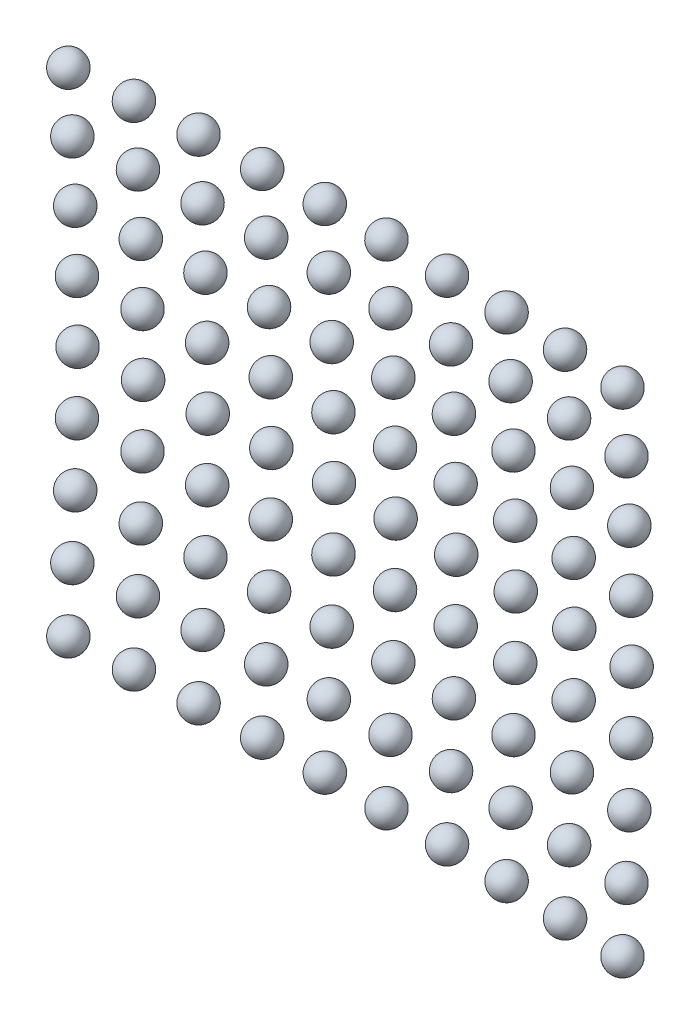
ISO-10303-21;
HEADER;
FILE_DESCRIPTION(('STEP AP214'),'2;1');
FILE_NAME('part.step','',(''),(''),'','','');
FILE_SCHEMA(('AUTOMOTIVE_DESIGN { 1 0 10303 214 1 1 1 1 }'));
ENDSEC;
DATA;
#1=APPLICATION_CONTEXT('core data for automotive mechanical design processes');
#2=APPLICATION_PROTOCOL_DEFINITION('international standard','automotive_design',2000,#1);
#3=PRODUCT_CONTEXT('',#1,'mechanical');
#4=PRODUCT('Part','Part','',(#3));
#5=PRODUCT_RELATED_PRODUCT_CATEGORY('part','',(#4));
#6=PRODUCT_DEFINITION_FORMATION('','',#4);
#7=PRODUCT_DEFINITION_CONTEXT('part definition',#1,'design');
#8=PRODUCT_DEFINITION('design','',#6,#7);
#9=PRODUCT_DEFINITION_SHAPE('','',#8);
#10=(LENGTH_UNIT() NAMED_UNIT(*) SI_UNIT(.MILLI.,.METRE.));
#11=(NAMED_UNIT(*) PLANE_ANGLE_UNIT() SI_UNIT($,.RADIAN.));
#12=(NAMED_UNIT(*) SI_UNIT($,.STERADIAN.) SOLID_ANGLE_UNIT());
#13=UNCERTAINTY_MEASURE_WITH_UNIT(LENGTH_MEASURE(1.E-05),#10,'distance_accuracy_value','');
#14=(GEOMETRIC_REPRESENTATION_CONTEXT(3) GLOBAL_UNCERTAINTY_ASSIGNED_CONTEXT((#13)) GLOBAL_UNIT_ASSIGNED_CONTEXT((#10,
#11,#12)) REPRESENTATION_CONTEXT('',''));
#15=CARTESIAN_POINT('',(0.,0.,0.));
#16=DIRECTION('',(0.,0.,1.));
#17=DIRECTION('',(1.,0.,0.));
#18=AXIS2_PLACEMENT_3D('',#15,#16,#17);
#19=CARTESIAN_POINT('',(8.00817179263602,-8.9214419487475,0.747647017793937));
#20=DIRECTION('',(0.,0.,-1.));
#21=DIRECTION('',(0.,-1.,0.));
#22=AXIS2_PLACEMENT_3D('',#19,#20,#21);
#23=SPHERICAL_SURFACE('',#22,0.5);
#24=CARTESIAN_POINT('',(8.00817179263602,-8.9214419487475,0.247647017793937));
#25=VERTEX_POINT('',#24);
#26=VERTEX_LOOP('',#25);
#27=FACE_BOUND('',#26,.T.);
#28=ADVANCED_FACE('F45',(#27),#23,.T.);
#29=CLOSED_SHELL('',(#28));
#30=MANIFOLD_SOLID_BREP('B2',#29);
#31=CARTESIAN_POINT('',(6.01259338943925,-8.9214419487475,0.615076387186788));
#32=DIRECTION('',(0.,0.,-1.));
#33=DIRECTION('',(0.,-1.,0.));
#34=AXIS2_PLACEMENT_3D('',#31,#32,#33);
#35=SPHERICAL_SURFACE('',#34,0.5);
#36=CARTESIAN_POINT('',(6.01259338943925,-8.9214419487475,0.115076387186788));
#37=VERTEX_POINT('',#36);
#38=VERTEX_LOOP('',#37);
#39=FACE_BOUND('',#38,.T.);
#40=ADVANCED_FACE('F65',(#39),#35,.T.);
#41=CLOSED_SHELL('',(#40));
#42=MANIFOLD_SOLID_BREP('B6',#41);
#43=CARTESIAN_POINT('',(4.01508925056326,-8.9214419487475,0.515651286844554));
#44=DIRECTION('',(0.,0.,-1.));
#45=DIRECTION('',(0.,-1.,0.));
#46=AXIS2_PLACEMENT_3D('',#43,#44,#45);
#47=SPHERICAL_SURFACE('',#46,0.5);
#48=CARTESIAN_POINT('',(4.01508925056326,-8.9214419487475,0.0156512868445537));
#49=VERTEX_POINT('',#48);
#50=VERTEX_LOOP('',#49);
#51=FACE_BOUND('',#50,.T.);
#52=ADVANCED_FACE('F85',(#51),#47,.T.);
#53=CLOSED_SHELL('',(#52));
#54=MANIFOLD_SOLID_BREP('B41',#53);
#55=CARTESIAN_POINT('',(2.01620986814937,-8.9214419487475,0.449399117329413));
#56=DIRECTION('',(0.,0.,-1.));
#57=DIRECTION('',(0.,-1.,0.));
#58=AXIS2_PLACEMENT_3D('',#55,#56,#57);
#59=SPHERICAL_SURFACE('',#58,0.5);
#60=CARTESIAN_POINT('',(2.01620986814937,-8.9214419487475,-0.0506008826705871));
#61=VERTEX_POINT('',#60);
#62=VERTEX_LOOP('',#61);
#63=FACE_BOUND('',#62,.T.);
#64=ADVANCED_FACE('F106',(#63),#59,.T.);
#65=CLOSED_SHELL('',(#64));
#66=MANIFOLD_SOLID_BREP('B61',#65);
#67=CARTESIAN_POINT('',(0.0165061133422777,-8.9214419487475,0.416338137075991));
#68=DIRECTION('',(0.,0.,-1.));
#69=DIRECTION('',(0.,-1.,0.));
#70=AXIS2_PLACEMENT_3D('',#67,#68,#69);
#71=SPHERICAL_SURFACE('',#70,0.5);
#72=CARTESIAN_POINT('',(0.0165061133422777,-8.9214419487475,-0.0836618629240086));
#73=VERTEX_POINT('',#72);
#74=VERTEX_LOOP('',#73);
#75=FACE_BOUND('',#74,.T.);
#76=ADVANCED_FACE('F127',(#75),#71,.T.);
#77=CLOSED_SHELL('',(#76));
#78=MANIFOLD_SOLID_BREP('B81',#77);
#79=CARTESIAN_POINT('',(-1.98347091552447,-8.9214419487475,0.416477457359412));
#80=DIRECTION('',(0.,0.,-1.));
#81=DIRECTION('',(0.,-1.,0.));
#82=AXIS2_PLACEMENT_3D('',#79,#80,#81);
#83=SPHERICAL_SURFACE('',#82,0.5);
#84=CARTESIAN_POINT('',(-1.98347091552447,-8.9214419487475,-0.0835225426405876));
#85=VERTEX_POINT('',#84);
#86=VERTEX_LOOP('',#85);
#87=FACE_BOUND('',#86,.T.);
#88=ADVANCED_FACE('F148',(#87),#83,.T.);
#89=CLOSED_SHELL('',(#88));
#90=MANIFOLD_SOLID_BREP('B102',#89);
#91=CARTESIAN_POINT('',(-3.98317004480583,-8.9214419487475,0.449817039784403));
#92=DIRECTION('',(0.,0.,-1.));
#93=DIRECTION('',(0.,-1.,0.));
#94=AXIS2_PLACEMENT_3D('',#91,#92,#93);
#95=SPHERICAL_SURFACE('',#94,0.5);
#96=CARTESIAN_POINT('',(-3.98317004480583,-8.9214419487475,-0.0501829602155971));
#97=VERTEX_POINT('',#96);
#98=VERTEX_LOOP('',#97);
#99=FACE_BOUND('',#98,.T.);
#100=ADVANCED_FACE('F169',(#99),#95,.T.);
#101=CLOSED_SHELL('',(#100));
#102=MANIFOLD_SOLID_BREP('B123',#101);
#103=CARTESIAN_POINT('',(-5.982040177443,-8.9214419487475,0.516347696295841));
#104=DIRECTION('',(0.,0.,-1.));
#105=DIRECTION('',(0.,-1.,0.));
#106=AXIS2_PLACEMENT_3D('',#103,#104,#105);
#107=SPHERICAL_SURFACE('',#106,0.5);
#108=CARTESIAN_POINT('',(-5.982040177443,-8.9214419487475,0.0163476962958405));
#109=VERTEX_POINT('',#108);
#110=VERTEX_LOOP('',#109);
#111=FACE_BOUND('',#110,.T.);
#112=ADVANCED_FACE('F190',(#111),#107,.T.);
#113=CLOSED_SHELL('',(#112));
#114=MANIFOLD_SOLID_BREP('B144',#113);
#115=CARTESIAN_POINT('',(-7.97953044484047,-8.9214419487475,0.616051091710923));
#116=DIRECTION('',(0.,0.,-1.));
#117=DIRECTION('',(0.,-1.,0.));
#118=AXIS2_PLACEMENT_3D('',#115,#116,#117);
#119=SPHERICAL_SURFACE('',#118,0.5);
#120=CARTESIAN_POINT('',(-7.97953044484047,-8.9214419487475,0.116051091710923));
#121=VERTEX_POINT('',#120);
#122=VERTEX_LOOP('',#121);
#123=FACE_BOUND('',#122,.T.);
#124=ADVANCED_FACE('F211',(#123),#119,.T.);
#125=CLOSED_SHELL('',(#124));
#126=MANIFOLD_SOLID_BREP('B165',#125);
#127=CARTESIAN_POINT('',(-9.97509035867965,-8.9214419487475,0.748899748772111));
#128=DIRECTION('',(0.,0.,-1.));
#129=DIRECTION('',(0.,-1.,0.));
#130=AXIS2_PLACEMENT_3D('',#127,#128,#129);
#131=SPHERICAL_SURFACE('',#130,0.5);
#132=CARTESIAN_POINT('',(-9.97509035867965,-8.9214419487475,0.248899748772111));
#133=VERTEX_POINT('',#132);
#134=VERTEX_LOOP('',#133);
#135=FACE_BOUND('',#134,.T.);
#136=ADVANCED_FACE('F232',(#135),#131,.T.);
#137=CLOSED_SHELL('',(#136));
#138=MANIFOLD_SOLID_BREP('B186',#137);
#139=CARTESIAN_POINT('',(8.00817179263602,-6.92569907133099,0.617666145492551));
#140=DIRECTION('',(0.,0.,-1.));
#141=DIRECTION('',(0.,-1.,0.));
#142=AXIS2_PLACEMENT_3D('',#139,#140,#141);
#143=SPHERICAL_SURFACE('',#142,0.5);
#144=CARTESIAN_POINT('',(8.00817179263602,-6.92569907133099,0.117666145492551));
#145=VERTEX_POINT('',#144);
#146=VERTEX_LOOP('',#145);
#147=FACE_BOUND('',#146,.T.);
#148=ADVANCED_FACE('F252',(#147),#143,.T.);
#149=CLOSED_SHELL('',(#148));
#150=MANIFOLD_SOLID_BREP('B207',#149);
#151=CARTESIAN_POINT('',(6.01259338943925,-6.92569907133099,0.485095514885403));
#152=DIRECTION('',(0.,0.,-1.));
#153=DIRECTION('',(0.,-1.,0.));
#154=AXIS2_PLACEMENT_3D('',#151,#152,#153);
#155=SPHERICAL_SURFACE('',#154,0.5);
#156=CARTESIAN_POINT('',(6.01259338943925,-6.92569907133099,-0.0149044851145972));
#157=VERTEX_POINT('',#156);
#158=VERTEX_LOOP('',#157);
#159=FACE_BOUND('',#158,.T.);
#160=ADVANCED_FACE('F272',(#159),#155,.T.);
#161=CLOSED_SHELL('',(#160));
#162=MANIFOLD_SOLID_BREP('B228',#161);
#163=CARTESIAN_POINT('',(4.01508925056326,-6.92569907133099,0.385670414543168));
#164=DIRECTION('',(0.,0.,-1.));
#165=DIRECTION('',(0.,-1.,0.));
#166=AXIS2_PLACEMENT_3D('',#163,#164,#165);
#167=SPHERICAL_SURFACE('',#166,0.5);
#168=CARTESIAN_POINT('',(4.01508925056326,-6.92569907133099,-0.114329585456832));
#169=VERTEX_POINT('',#168);
#170=VERTEX_LOOP('',#169);
#171=FACE_BOUND('',#170,.T.);
#172=ADVANCED_FACE('F292',(#171),#167,.T.);
#173=CLOSED_SHELL('',(#172));
#174=MANIFOLD_SOLID_BREP('B248',#173);
#175=CARTESIAN_POINT('',(2.01620986814937,-6.92569907133099,0.319418245028027));
#176=DIRECTION('',(0.,0.,-1.));
#177=DIRECTION('',(0.,-1.,0.));
#178=AXIS2_PLACEMENT_3D('',#175,#176,#177);
#179=SPHERICAL_SURFACE('',#178,0.5);
#180=CARTESIAN_POINT('',(2.01620986814937,-6.92569907133099,-0.180581754971973));
#181=VERTEX_POINT('',#180);
#182=VERTEX_LOOP('',#181);
#183=FACE_BOUND('',#182,.T.);
#184=ADVANCED_FACE('F313',(#183),#179,.T.);
#185=CLOSED_SHELL('',(#184));
#186=MANIFOLD_SOLID_BREP('B268',#185);
#187=CARTESIAN_POINT('',(0.0165061133422777,-6.92569907133099,0.286357264774606));
#188=DIRECTION('',(0.,0.,-1.));
#189=DIRECTION('',(0.,-1.,0.));
#190=AXIS2_PLACEMENT_3D('',#187,#188,#189);
#191=SPHERICAL_SURFACE('',#190,0.5);
#192=CARTESIAN_POINT('',(0.0165061133422777,-6.92569907133099,-0.213642735225394));
#193=VERTEX_POINT('',#192);
#194=VERTEX_LOOP('',#193);
#195=FACE_BOUND('',#194,.T.);
#196=ADVANCED_FACE('F334',(#195),#191,.T.);
#197=CLOSED_SHELL('',(#196));
#198=MANIFOLD_SOLID_BREP('B288',#197);
#199=CARTESIAN_POINT('',(-1.98347091552447,-6.92569907133099,0.286496585058027));
#200=DIRECTION('',(0.,0.,-1.));
#201=DIRECTION('',(0.,-1.,0.));
#202=AXIS2_PLACEMENT_3D('',#199,#200,#201);
#203=SPHERICAL_SURFACE('',#202,0.5);
#204=CARTESIAN_POINT('',(-1.98347091552447,-6.92569907133099,-0.213503414941973));
#205=VERTEX_POINT('',#204);
#206=VERTEX_LOOP('',#205);
#207=FACE_BOUND('',#206,.T.);
#208=ADVANCED_FACE('F355',(#207),#203,.T.);
#209=CLOSED_SHELL('',(#208));
#210=MANIFOLD_SOLID_BREP('B309',#209);
#211=CARTESIAN_POINT('',(-3.98317004480583,-6.92569907133099,0.319836167483017));
#212=DIRECTION('',(0.,0.,-1.));
#213=DIRECTION('',(0.,-1.,0.));
#214=AXIS2_PLACEMENT_3D('',#211,#212,#213);
#215=SPHERICAL_SURFACE('',#214,0.5);
#216=CARTESIAN_POINT('',(-3.98317004480583,-6.92569907133099,-0.180163832516983));
#217=VERTEX_POINT('',#216);
#218=VERTEX_LOOP('',#217);
#219=FACE_BOUND('',#218,.T.);
#220=ADVANCED_FACE('F376',(#219),#215,.T.);
#221=CLOSED_SHELL('',(#220));
#222=MANIFOLD_SOLID_BREP('B330',#221);
#223=CARTESIAN_POINT('',(-5.982040177443,-6.92569907133099,0.386366823994455));
#224=DIRECTION('',(0.,0.,-1.));
#225=DIRECTION('',(0.,-1.,0.));
#226=AXIS2_PLACEMENT_3D('',#223,#224,#225);
#227=SPHERICAL_SURFACE('',#226,0.5);
#228=CARTESIAN_POINT('',(-5.982040177443,-6.92569907133099,-0.113633176005545));
#229=VERTEX_POINT('',#228);
#230=VERTEX_LOOP('',#229);
#231=FACE_BOUND('',#230,.T.);
#232=ADVANCED_FACE('F397',(#231),#227,.T.);
#233=CLOSED_SHELL('',(#232));
#234=MANIFOLD_SOLID_BREP('B351',#233);
#235=CARTESIAN_POINT('',(-7.97953044484047,-6.92569907133099,0.486070219409537));
#236=DIRECTION('',(0.,0.,-1.));
#237=DIRECTION('',(0.,-1.,0.));
#238=AXIS2_PLACEMENT_3D('',#235,#236,#237);
#239=SPHERICAL_SURFACE('',#238,0.5);
#240=CARTESIAN_POINT('',(-7.97953044484047,-6.92569907133099,-0.0139297805904629));
#241=VERTEX_POINT('',#240);
#242=VERTEX_LOOP('',#241);
#243=FACE_BOUND('',#242,.T.);
#244=ADVANCED_FACE('F418',(#243),#239,.T.);
#245=CLOSED_SHELL('',(#244));
#246=MANIFOLD_SOLID_BREP('B372',#245);
#247=CARTESIAN_POINT('',(-9.97509035867965,-6.92569907133099,0.618918876470725));
#248=DIRECTION('',(0.,0.,-1.));
#249=DIRECTION('',(0.,-1.,0.));
#250=AXIS2_PLACEMENT_3D('',#247,#248,#249);
#251=SPHERICAL_SURFACE('',#250,0.5);
#252=CARTESIAN_POINT('',(-9.97509035867965,-6.92569907133099,0.118918876470725));
#253=VERTEX_POINT('',#252);
#254=VERTEX_LOOP('',#253);
#255=FACE_BOUND('',#254,.T.);
#256=ADVANCED_FACE('F439',(#255),#251,.T.);
#257=CLOSED_SHELL('',(#256));
#258=MANIFOLD_SOLID_BREP('B393',#257);
#259=CARTESIAN_POINT('',(8.00817179263602,-4.92788374246977,0.524829882696809));
#260=DIRECTION('',(0.,0.,-1.));
#261=DIRECTION('',(0.,-1.,0.));
#262=AXIS2_PLACEMENT_3D('',#259,#260,#261);
#263=SPHERICAL_SURFACE('',#262,0.5);
#264=CARTESIAN_POINT('',(8.00817179263602,-4.92788374246977,0.0248298826968087));
#265=VERTEX_POINT('',#264);
#266=VERTEX_LOOP('',#265);
#267=FACE_BOUND('',#266,.T.);
#268=ADVANCED_FACE('F459',(#267),#263,.T.);
#269=CLOSED_SHELL('',(#268));
#270=MANIFOLD_SOLID_BREP('B414',#269);
#271=CARTESIAN_POINT('',(6.01259338943925,-4.92788374246977,0.39225925208966));
#272=DIRECTION('',(0.,0.,-1.));
#273=DIRECTION('',(0.,-1.,0.));
#274=AXIS2_PLACEMENT_3D('',#271,#272,#273);
#275=SPHERICAL_SURFACE('',#274,0.5);
#276=CARTESIAN_POINT('',(6.01259338943925,-4.92788374246977,-0.10774074791034));
#277=VERTEX_POINT('',#276);
#278=VERTEX_LOOP('',#277);
#279=FACE_BOUND('',#278,.T.);
#280=ADVANCED_FACE('F479',(#279),#275,.T.);
#281=CLOSED_SHELL('',(#280));
#282=MANIFOLD_SOLID_BREP('B435',#281);
#283=CARTESIAN_POINT('',(4.01508925056326,-4.92788374246977,0.292834151747426));
#284=DIRECTION('',(0.,0.,-1.));
#285=DIRECTION('',(0.,-1.,0.));
#286=AXIS2_PLACEMENT_3D('',#283,#284,#285);
#287=SPHERICAL_SURFACE('',#286,0.5);
#288=CARTESIAN_POINT('',(4.01508925056326,-4.92788374246977,-0.207165848252574));
#289=VERTEX_POINT('',#288);
#290=VERTEX_LOOP('',#289);
#291=FACE_BOUND('',#290,.T.);
#292=ADVANCED_FACE('F499',(#291),#287,.T.);
#293=CLOSED_SHELL('',(#292));
#294=MANIFOLD_SOLID_BREP('B455',#293);
#295=CARTESIAN_POINT('',(2.01620986814937,-4.92788374246977,0.226581982232285));
#296=DIRECTION('',(0.,0.,-1.));
#297=DIRECTION('',(0.,-1.,0.));
#298=AXIS2_PLACEMENT_3D('',#295,#296,#297);
#299=SPHERICAL_SURFACE('',#298,0.5);
#300=CARTESIAN_POINT('',(2.01620986814937,-4.92788374246977,-0.273418017767715));
#301=VERTEX_POINT('',#300);
#302=VERTEX_LOOP('',#301);
#303=FACE_BOUND('',#302,.T.);
#304=ADVANCED_FACE('F520',(#303),#299,.T.);
#305=CLOSED_SHELL('',(#304));
#306=MANIFOLD_SOLID_BREP('B475',#305);
#307=CARTESIAN_POINT('',(0.0165061133422777,-4.92788374246977,0.193521001978863));
#308=DIRECTION('',(0.,0.,-1.));
#309=DIRECTION('',(0.,-1.,0.));
#310=AXIS2_PLACEMENT_3D('',#307,#308,#309);
#311=SPHERICAL_SURFACE('',#310,0.5);
#312=CARTESIAN_POINT('',(0.0165061133422777,-4.92788374246977,-0.306478998021137));
#313=VERTEX_POINT('',#312);
#314=VERTEX_LOOP('',#313);
#315=FACE_BOUND('',#314,.T.);
#316=ADVANCED_FACE('F541',(#315),#311,.T.);
#317=CLOSED_SHELL('',(#316));
#318=MANIFOLD_SOLID_BREP('B495',#317);
#319=CARTESIAN_POINT('',(-1.98347091552447,-4.92788374246977,0.193660322262284));
#320=DIRECTION('',(0.,0.,-1.));
#321=DIRECTION('',(0.,-1.,0.));
#322=AXIS2_PLACEMENT_3D('',#319,#320,#321);
#323=SPHERICAL_SURFACE('',#322,0.5);
#324=CARTESIAN_POINT('',(-1.98347091552447,-4.92788374246977,-0.306339677737716));
#325=VERTEX_POINT('',#324);
#326=VERTEX_LOOP('',#325);
#327=FACE_BOUND('',#326,.T.);
#328=ADVANCED_FACE('F562',(#327),#323,.T.);
#329=CLOSED_SHELL('',(#328));
#330=MANIFOLD_SOLID_BREP('B516',#329);
#331=CARTESIAN_POINT('',(-3.98317004480583,-4.92788374246977,0.226999904687275));
#332=DIRECTION('',(0.,0.,-1.));
#333=DIRECTION('',(0.,-1.,0.));
#334=AXIS2_PLACEMENT_3D('',#331,#332,#333);
#335=SPHERICAL_SURFACE('',#334,0.5);
#336=CARTESIAN_POINT('',(-3.98317004480583,-4.92788374246977,-0.273000095312725));
#337=VERTEX_POINT('',#336);
#338=VERTEX_LOOP('',#337);
#339=FACE_BOUND('',#338,.T.);
#340=ADVANCED_FACE('F583',(#339),#335,.T.);
#341=CLOSED_SHELL('',(#340));
#342=MANIFOLD_SOLID_BREP('B537',#341);
#343=CARTESIAN_POINT('',(-5.982040177443,-4.92788374246977,0.293530561198712));
#344=DIRECTION('',(0.,0.,-1.));
#345=DIRECTION('',(0.,-1.,0.));
#346=AXIS2_PLACEMENT_3D('',#343,#344,#345);
#347=SPHERICAL_SURFACE('',#346,0.5);
#348=CARTESIAN_POINT('',(-5.982040177443,-4.92788374246977,-0.206469438801288));
#349=VERTEX_POINT('',#348);
#350=VERTEX_LOOP('',#349);
#351=FACE_BOUND('',#350,.T.);
#352=ADVANCED_FACE('F604',(#351),#347,.T.);
#353=CLOSED_SHELL('',(#352));
#354=MANIFOLD_SOLID_BREP('B558',#353);
#355=CARTESIAN_POINT('',(-7.97953044484047,-4.92788374246977,0.393233956613795));
#356=DIRECTION('',(0.,0.,-1.));
#357=DIRECTION('',(0.,-1.,0.));
#358=AXIS2_PLACEMENT_3D('',#355,#356,#357);
#359=SPHERICAL_SURFACE('',#358,0.5);
#360=CARTESIAN_POINT('',(-7.97953044484047,-4.92788374246977,-0.106766043386205));
#361=VERTEX_POINT('',#360);
#362=VERTEX_LOOP('',#361);
#363=FACE_BOUND('',#362,.T.);
#364=ADVANCED_FACE('F625',(#363),#359,.T.);
#365=CLOSED_SHELL('',(#364));
#366=MANIFOLD_SOLID_BREP('B579',#365);
#367=CARTESIAN_POINT('',(-9.97509035867965,-4.92788374246977,0.526082613674983));
#368=DIRECTION('',(0.,0.,-1.));
#369=DIRECTION('',(0.,-1.,0.));
#370=AXIS2_PLACEMENT_3D('',#367,#368,#369);
#371=SPHERICAL_SURFACE('',#370,0.5);
#372=CARTESIAN_POINT('',(-9.97509035867965,-4.92788374246977,0.0260826136749828));
#373=VERTEX_POINT('',#372);
#374=VERTEX_LOOP('',#373);
#375=FACE_BOUND('',#374,.T.);
#376=ADVANCED_FACE('F646',(#375),#371,.T.);
#377=CLOSED_SHELL('',(#376));
#378=MANIFOLD_SOLID_BREP('B600',#377);
#379=CARTESIAN_POINT('',(8.00817179263602,-2.92868723472621,0.469170352076081));
#380=DIRECTION('',(0.,0.,-1.));
#381=DIRECTION('',(0.,-1.,0.));
#382=AXIS2_PLACEMENT_3D('',#379,#380,#381);
#383=SPHERICAL_SURFACE('',#382,0.5);
#384=CARTESIAN_POINT('',(8.00817179263602,-2.92868723472621,-0.0308296479239187));
#385=VERTEX_POINT('',#384);
#386=VERTEX_LOOP('',#385);
#387=FACE_BOUND('',#386,.T.);
#388=ADVANCED_FACE('F666',(#387),#383,.T.);
#389=CLOSED_SHELL('',(#388));
#390=MANIFOLD_SOLID_BREP('B621',#389);
#391=CARTESIAN_POINT('',(6.01259338943925,-2.92868723472621,0.336599721468933));
#392=DIRECTION('',(0.,0.,-1.));
#393=DIRECTION('',(0.,-1.,0.));
#394=AXIS2_PLACEMENT_3D('',#391,#392,#393);
#395=SPHERICAL_SURFACE('',#394,0.5);
#396=CARTESIAN_POINT('',(6.01259338943925,-2.92868723472621,-0.163400278531067));
#397=VERTEX_POINT('',#396);
#398=VERTEX_LOOP('',#397);
#399=FACE_BOUND('',#398,.T.);
#400=ADVANCED_FACE('F686',(#399),#395,.T.);
#401=CLOSED_SHELL('',(#400));
#402=MANIFOLD_SOLID_BREP('B642',#401);
#403=CARTESIAN_POINT('',(4.01508925056326,-2.92868723472621,0.237174621126698));
#404=DIRECTION('',(0.,0.,-1.));
#405=DIRECTION('',(0.,-1.,0.));
#406=AXIS2_PLACEMENT_3D('',#403,#404,#405);
#407=SPHERICAL_SURFACE('',#406,0.5);
#408=CARTESIAN_POINT('',(4.01508925056326,-2.92868723472621,-0.262825378873302));
#409=VERTEX_POINT('',#408);
#410=VERTEX_LOOP('',#409);
#411=FACE_BOUND('',#410,.T.);
#412=ADVANCED_FACE('F706',(#411),#407,.T.);
#413=CLOSED_SHELL('',(#412));
#414=MANIFOLD_SOLID_BREP('B662',#413);
#415=CARTESIAN_POINT('',(2.01620986814937,-2.92868723472621,0.170922451611557));
#416=DIRECTION('',(0.,0.,-1.));
#417=DIRECTION('',(0.,-1.,0.));
#418=AXIS2_PLACEMENT_3D('',#415,#416,#417);
#419=SPHERICAL_SURFACE('',#418,0.5);
#420=CARTESIAN_POINT('',(2.01620986814937,-2.92868723472621,-0.329077548388443));
#421=VERTEX_POINT('',#420);
#422=VERTEX_LOOP('',#421);
#423=FACE_BOUND('',#422,.T.);
#424=ADVANCED_FACE('F727',(#423),#419,.T.);
#425=CLOSED_SHELL('',(#424));
#426=MANIFOLD_SOLID_BREP('B682',#425);
#427=CARTESIAN_POINT('',(0.0165061133422777,-2.92868723472621,0.137861471358136));
#428=DIRECTION('',(0.,0.,-1.));
#429=DIRECTION('',(0.,-1.,0.));
#430=AXIS2_PLACEMENT_3D('',#427,#428,#429);
#431=SPHERICAL_SURFACE('',#430,0.5);
#432=CARTESIAN_POINT('',(0.0165061133422777,-2.92868723472621,-0.362138528641864));
#433=VERTEX_POINT('',#432);
#434=VERTEX_LOOP('',#433);
#435=FACE_BOUND('',#434,.T.);
#436=ADVANCED_FACE('F748',(#435),#431,.T.);
#437=CLOSED_SHELL('',(#436));
#438=MANIFOLD_SOLID_BREP('B702',#437);
#439=CARTESIAN_POINT('',(-1.98347091552447,-2.92868723472621,0.138000791641557));
#440=DIRECTION('',(0.,0.,-1.));
#441=DIRECTION('',(0.,-1.,0.));
#442=AXIS2_PLACEMENT_3D('',#439,#440,#441);
#443=SPHERICAL_SURFACE('',#442,0.5);
#444=CARTESIAN_POINT('',(-1.98347091552447,-2.92868723472621,-0.361999208358443));
#445=VERTEX_POINT('',#444);
#446=VERTEX_LOOP('',#445);
#447=FACE_BOUND('',#446,.T.);
#448=ADVANCED_FACE('F769',(#447),#443,.T.);
#449=CLOSED_SHELL('',(#448));
#450=MANIFOLD_SOLID_BREP('B723',#449);
#451=CARTESIAN_POINT('',(-3.98317004480583,-2.92868723472621,0.171340374066547));
#452=DIRECTION('',(0.,0.,-1.));
#453=DIRECTION('',(0.,-1.,0.));
#454=AXIS2_PLACEMENT_3D('',#451,#452,#453);
#455=SPHERICAL_SURFACE('',#454,0.5);
#456=CARTESIAN_POINT('',(-3.98317004480583,-2.92868723472621,-0.328659625933453));
#457=VERTEX_POINT('',#456);
#458=VERTEX_LOOP('',#457);
#459=FACE_BOUND('',#458,.T.);
#460=ADVANCED_FACE('F790',(#459),#455,.T.);
#461=CLOSED_SHELL('',(#460));
#462=MANIFOLD_SOLID_BREP('B744',#461);
#463=CARTESIAN_POINT('',(-5.982040177443,-2.92868723472621,0.237871030577985));
#464=DIRECTION('',(0.,0.,-1.));
#465=DIRECTION('',(0.,-1.,0.));
#466=AXIS2_PLACEMENT_3D('',#463,#464,#465);
#467=SPHERICAL_SURFACE('',#466,0.5);
#468=CARTESIAN_POINT('',(-5.982040177443,-2.92868723472621,-0.262128969422015));
#469=VERTEX_POINT('',#468);
#470=VERTEX_LOOP('',#469);
#471=FACE_BOUND('',#470,.T.);
#472=ADVANCED_FACE('F811',(#471),#467,.T.);
#473=CLOSED_SHELL('',(#472));
#474=MANIFOLD_SOLID_BREP('B765',#473);
#475=CARTESIAN_POINT('',(-7.97953044484047,-2.92868723472621,0.337574425993067));
#476=DIRECTION('',(0.,0.,-1.));
#477=DIRECTION('',(0.,-1.,0.));
#478=AXIS2_PLACEMENT_3D('',#475,#476,#477);
#479=SPHERICAL_SURFACE('',#478,0.5);
#480=CARTESIAN_POINT('',(-7.97953044484047,-2.92868723472621,-0.162425574006933));
#481=VERTEX_POINT('',#480);
#482=VERTEX_LOOP('',#481);
#483=FACE_BOUND('',#482,.T.);
#484=ADVANCED_FACE('F832',(#483),#479,.T.);
#485=CLOSED_SHELL('',(#484));
#486=MANIFOLD_SOLID_BREP('B786',#485);
#487=CARTESIAN_POINT('',(-9.97509035867965,-2.92868723472621,0.470423083054255));
#488=DIRECTION('',(0.,0.,-1.));
#489=DIRECTION('',(0.,-1.,0.));
#490=AXIS2_PLACEMENT_3D('',#487,#488,#489);
#491=SPHERICAL_SURFACE('',#490,0.5);
#492=CARTESIAN_POINT('',(-9.97509035867965,-2.92868723472621,-0.0295769169457447));
#493=VERTEX_POINT('',#492);
#494=VERTEX_LOOP('',#493);
#495=FACE_BOUND('',#494,.T.);
#496=ADVANCED_FACE('F853',(#495),#491,.T.);
#497=CLOSED_SHELL('',(#496));
#498=MANIFOLD_SOLID_BREP('B807',#497);
#499=CARTESIAN_POINT('',(8.00817179263602,-0.928801298570512,0.450706812620813));
#500=DIRECTION('',(0.,0.,-1.));
#501=DIRECTION('',(0.,-1.,0.));
#502=AXIS2_PLACEMENT_3D('',#499,#500,#501);
#503=SPHERICAL_SURFACE('',#502,0.5);
#504=CARTESIAN_POINT('',(8.00817179263602,-0.928801298570512,-0.0492931873791872));
#505=VERTEX_POINT('',#504);
#506=VERTEX_LOOP('',#505);
#507=FACE_BOUND('',#506,.T.);
#508=ADVANCED_FACE('F873',(#507),#503,.T.);
#509=CLOSED_SHELL('',(#508));
#510=MANIFOLD_SOLID_BREP('B828',#509);
#511=CARTESIAN_POINT('',(6.01259338943925,-0.928801298570512,0.318136182013664));
#512=DIRECTION('',(0.,0.,-1.));
#513=DIRECTION('',(0.,-1.,0.));
#514=AXIS2_PLACEMENT_3D('',#511,#512,#513);
#515=SPHERICAL_SURFACE('',#514,0.5);
#516=CARTESIAN_POINT('',(6.01259338943925,-0.928801298570512,-0.181863817986336));
#517=VERTEX_POINT('',#516);
#518=VERTEX_LOOP('',#517);
#519=FACE_BOUND('',#518,.T.);
#520=ADVANCED_FACE('F893',(#519),#515,.T.);
#521=CLOSED_SHELL('',(#520));
#522=MANIFOLD_SOLID_BREP('B849',#521);
#523=CARTESIAN_POINT('',(4.01508925056326,-0.928801298570512,0.21871108167143));
#524=DIRECTION('',(0.,0.,-1.));
#525=DIRECTION('',(0.,-1.,0.));
#526=AXIS2_PLACEMENT_3D('',#523,#524,#525);
#527=SPHERICAL_SURFACE('',#526,0.5);
#528=CARTESIAN_POINT('',(4.01508925056326,-0.928801298570512,-0.28128891832857));
#529=VERTEX_POINT('',#528);
#530=VERTEX_LOOP('',#529);
#531=FACE_BOUND('',#530,.T.);
#532=ADVANCED_FACE('F913',(#531),#527,.T.);
#533=CLOSED_SHELL('',(#532));
#534=MANIFOLD_SOLID_BREP('B869',#533);
#535=CARTESIAN_POINT('',(2.01620986814937,-0.928801298570512,0.152458912156289));
#536=DIRECTION('',(0.,0.,-1.));
#537=DIRECTION('',(0.,-1.,0.));
#538=AXIS2_PLACEMENT_3D('',#535,#536,#537);
#539=SPHERICAL_SURFACE('',#538,0.5);
#540=CARTESIAN_POINT('',(2.01620986814937,-0.928801298570512,-0.347541087843711));
#541=VERTEX_POINT('',#540);
#542=VERTEX_LOOP('',#541);
#543=FACE_BOUND('',#542,.T.);
#544=ADVANCED_FACE('F934',(#543),#539,.T.);
#545=CLOSED_SHELL('',(#544));
#546=MANIFOLD_SOLID_BREP('B889',#545);
#547=CARTESIAN_POINT('',(0.0165061133422777,-0.928801298570512,0.119397931902867));
#548=DIRECTION('',(0.,0.,-1.));
#549=DIRECTION('',(0.,-1.,0.));
#550=AXIS2_PLACEMENT_3D('',#547,#548,#549);
#551=SPHERICAL_SURFACE('',#550,0.5);
#552=CARTESIAN_POINT('',(0.0165061133422777,-0.928801298570512,-0.380602068097133));
#553=VERTEX_POINT('',#552);
#554=VERTEX_LOOP('',#553);
#555=FACE_BOUND('',#554,.T.);
#556=ADVANCED_FACE('F955',(#555),#551,.T.);
#557=CLOSED_SHELL('',(#556));
#558=MANIFOLD_SOLID_BREP('B909',#557);
#559=CARTESIAN_POINT('',(-1.98347091552447,-0.928801298570512,0.119537252186288));
#560=DIRECTION('',(0.,0.,-1.));
#561=DIRECTION('',(0.,-1.,0.));
#562=AXIS2_PLACEMENT_3D('',#559,#560,#561);
#563=SPHERICAL_SURFACE('',#562,0.5);
#564=CARTESIAN_POINT('',(-1.98347091552447,-0.928801298570512,-0.380462747813712));
#565=VERTEX_POINT('',#564);
#566=VERTEX_LOOP('',#565);
#567=FACE_BOUND('',#566,.T.);
#568=ADVANCED_FACE('F976',(#567),#563,.T.);
#569=CLOSED_SHELL('',(#568));
#570=MANIFOLD_SOLID_BREP('B930',#569);
#571=CARTESIAN_POINT('',(-3.98317004480583,-0.928801298570512,0.152876834611279));
#572=DIRECTION('',(0.,0.,-1.));
#573=DIRECTION('',(0.,-1.,0.));
#574=AXIS2_PLACEMENT_3D('',#571,#572,#573);
#575=SPHERICAL_SURFACE('',#574,0.5);
#576=CARTESIAN_POINT('',(-3.98317004480583,-0.928801298570512,-0.347123165388721));
#577=VERTEX_POINT('',#576);
#578=VERTEX_LOOP('',#577);
#579=FACE_BOUND('',#578,.T.);
#580=ADVANCED_FACE('F997',(#579),#575,.T.);
#581=CLOSED_SHELL('',(#580));
#582=MANIFOLD_SOLID_BREP('B951',#581);
#583=CARTESIAN_POINT('',(-5.982040177443,-0.928801298570512,0.219407491122717));
#584=DIRECTION('',(0.,0.,-1.));
#585=DIRECTION('',(0.,-1.,0.));
#586=AXIS2_PLACEMENT_3D('',#583,#584,#585);
#587=SPHERICAL_SURFACE('',#586,0.5);
#588=CARTESIAN_POINT('',(-5.982040177443,-0.928801298570512,-0.280592508877283));
#589=VERTEX_POINT('',#588);
#590=VERTEX_LOOP('',#589);
#591=FACE_BOUND('',#590,.T.);
#592=ADVANCED_FACE('F1018',(#591),#587,.T.);
#593=CLOSED_SHELL('',(#592));
#594=MANIFOLD_SOLID_BREP('B972',#593);
#595=CARTESIAN_POINT('',(-7.97953044484047,-0.928801298570512,0.319110886537799));
#596=DIRECTION('',(0.,0.,-1.));
#597=DIRECTION('',(0.,-1.,0.));
#598=AXIS2_PLACEMENT_3D('',#595,#596,#597);
#599=SPHERICAL_SURFACE('',#598,0.5);
#600=CARTESIAN_POINT('',(-7.97953044484047,-0.928801298570512,-0.180889113462201));
#601=VERTEX_POINT('',#600);
#602=VERTEX_LOOP('',#601);
#603=FACE_BOUND('',#602,.T.);
#604=ADVANCED_FACE('F1039',(#603),#599,.T.);
#605=CLOSED_SHELL('',(#604));
#606=MANIFOLD_SOLID_BREP('B993',#605);
#607=CARTESIAN_POINT('',(-9.97509035867965,-0.928801298570512,0.451959543598987));
#608=DIRECTION('',(0.,0.,-1.));
#609=DIRECTION('',(0.,-1.,0.));
#610=AXIS2_PLACEMENT_3D('',#607,#608,#609);
#611=SPHERICAL_SURFACE('',#610,0.5);
#612=CARTESIAN_POINT('',(-9.97509035867965,-0.928801298570512,-0.0480404564010132));
#613=VERTEX_POINT('',#612);
#614=VERTEX_LOOP('',#613);
#615=FACE_BOUND('',#614,.T.);
#616=ADVANCED_FACE('F1060',(#615),#611,.T.);
#617=CLOSED_SHELL('',(#616));
#618=MANIFOLD_SOLID_BREP('B1014',#617);
#619=CARTESIAN_POINT('',(8.00817179263602,1.07108207697542,0.469445652978698));
#620=DIRECTION('',(0.,0.,-1.));
#621=DIRECTION('',(0.,-1.,0.));
#622=AXIS2_PLACEMENT_3D('',#619,#620,#621);
#623=SPHERICAL_SURFACE('',#622,0.5);
#624=CARTESIAN_POINT('',(8.00817179263602,1.07108207697542,-0.0305543470213024));
#625=VERTEX_POINT('',#624);
#626=VERTEX_LOOP('',#625);
#627=FACE_BOUND('',#626,.T.);
#628=ADVANCED_FACE('F1080',(#627),#623,.T.);
#629=CLOSED_SHELL('',(#628));
#630=MANIFOLD_SOLID_BREP('B1035',#629);
#631=CARTESIAN_POINT('',(6.01259338943925,1.07108207697542,0.336875022371549));
#632=DIRECTION('',(0.,0.,-1.));
#633=DIRECTION('',(0.,-1.,0.));
#634=AXIS2_PLACEMENT_3D('',#631,#632,#633);
#635=SPHERICAL_SURFACE('',#634,0.5);
#636=CARTESIAN_POINT('',(6.01259338943925,1.07108207697542,-0.163124977628451));
#637=VERTEX_POINT('',#636);
#638=VERTEX_LOOP('',#637);
#639=FACE_BOUND('',#638,.T.);
#640=ADVANCED_FACE('F1100',(#639),#635,.T.);
#641=CLOSED_SHELL('',(#640));
#642=MANIFOLD_SOLID_BREP('B1056',#641);
#643=CARTESIAN_POINT('',(4.01508925056326,1.07108207697542,0.237449922029314));
#644=DIRECTION('',(0.,0.,-1.));
#645=DIRECTION('',(0.,-1.,0.));
#646=AXIS2_PLACEMENT_3D('',#643,#644,#645);
#647=SPHERICAL_SURFACE('',#646,0.5);
#648=CARTESIAN_POINT('',(4.01508925056326,1.07108207697542,-0.262550077970686));
#649=VERTEX_POINT('',#648);
#650=VERTEX_LOOP('',#649);
#651=FACE_BOUND('',#650,.T.);
#652=ADVANCED_FACE('F1120',(#651),#647,.T.);
#653=CLOSED_SHELL('',(#652));
#654=MANIFOLD_SOLID_BREP('B1076',#653);
#655=CARTESIAN_POINT('',(2.01620986814937,1.07108207697542,0.171197752514174));
#656=DIRECTION('',(0.,0.,-1.));
#657=DIRECTION('',(0.,-1.,0.));
#658=AXIS2_PLACEMENT_3D('',#655,#656,#657);
#659=SPHERICAL_SURFACE('',#658,0.5);
#660=CARTESIAN_POINT('',(2.01620986814937,1.07108207697542,-0.328802247485826));
#661=VERTEX_POINT('',#660);
#662=VERTEX_LOOP('',#661);
#663=FACE_BOUND('',#662,.T.);
#664=ADVANCED_FACE('F1141',(#663),#659,.T.);
#665=CLOSED_SHELL('',(#664));
#666=MANIFOLD_SOLID_BREP('B1096',#665);
#667=CARTESIAN_POINT('',(0.0165061133422777,1.07108207697542,0.138136772260752));
#668=DIRECTION('',(0.,0.,-1.));
#669=DIRECTION('',(0.,-1.,0.));
#670=AXIS2_PLACEMENT_3D('',#667,#668,#669);
#671=SPHERICAL_SURFACE('',#670,0.5);
#672=CARTESIAN_POINT('',(0.0165061133422777,1.07108207697542,-0.361863227739248));
#673=VERTEX_POINT('',#672);
#674=VERTEX_LOOP('',#673);
#675=FACE_BOUND('',#674,.T.);
#676=ADVANCED_FACE('F1162',(#675),#671,.T.);
#677=CLOSED_SHELL('',(#676));
#678=MANIFOLD_SOLID_BREP('B1116',#677);
#679=CARTESIAN_POINT('',(-1.98347091552447,1.07108207697542,0.138276092544173));
#680=DIRECTION('',(0.,0.,-1.));
#681=DIRECTION('',(0.,-1.,0.));
#682=AXIS2_PLACEMENT_3D('',#679,#680,#681);
#683=SPHERICAL_SURFACE('',#682,0.5);
#684=CARTESIAN_POINT('',(-1.98347091552447,1.07108207697542,-0.361723907455827));
#685=VERTEX_POINT('',#684);
#686=VERTEX_LOOP('',#685);
#687=FACE_BOUND('',#686,.T.);
#688=ADVANCED_FACE('F1183',(#687),#683,.T.);
#689=CLOSED_SHELL('',(#688));
#690=MANIFOLD_SOLID_BREP('B1137',#689);
#691=CARTESIAN_POINT('',(-3.98317004480583,1.07108207697542,0.171615674969164));
#692=DIRECTION('',(0.,0.,-1.));
#693=DIRECTION('',(0.,-1.,0.));
#694=AXIS2_PLACEMENT_3D('',#691,#692,#693);
#695=SPHERICAL_SURFACE('',#694,0.5);
#696=CARTESIAN_POINT('',(-3.98317004480583,1.07108207697542,-0.328384325030836));
#697=VERTEX_POINT('',#696);
#698=VERTEX_LOOP('',#697);
#699=FACE_BOUND('',#698,.T.);
#700=ADVANCED_FACE('F1204',(#699),#695,.T.);
#701=CLOSED_SHELL('',(#700));
#702=MANIFOLD_SOLID_BREP('B1158',#701);
#703=CARTESIAN_POINT('',(-5.982040177443,1.07108207697542,0.238146331480601));
#704=DIRECTION('',(0.,0.,-1.));
#705=DIRECTION('',(0.,-1.,0.));
#706=AXIS2_PLACEMENT_3D('',#703,#704,#705);
#707=SPHERICAL_SURFACE('',#706,0.5);
#708=CARTESIAN_POINT('',(-5.982040177443,1.07108207697542,-0.261853668519399));
#709=VERTEX_POINT('',#708);
#710=VERTEX_LOOP('',#709);
#711=FACE_BOUND('',#710,.T.);
#712=ADVANCED_FACE('F1225',(#711),#707,.T.);
#713=CLOSED_SHELL('',(#712));
#714=MANIFOLD_SOLID_BREP('B1179',#713);
#715=CARTESIAN_POINT('',(-7.97953044484047,1.07108207697542,0.337849726895683));
#716=DIRECTION('',(0.,0.,-1.));
#717=DIRECTION('',(0.,-1.,0.));
#718=AXIS2_PLACEMENT_3D('',#715,#716,#717);
#719=SPHERICAL_SURFACE('',#718,0.5);
#720=CARTESIAN_POINT('',(-7.97953044484047,1.07108207697542,-0.162150273104317));
#721=VERTEX_POINT('',#720);
#722=VERTEX_LOOP('',#721);
#723=FACE_BOUND('',#722,.T.);
#724=ADVANCED_FACE('F1246',(#723),#719,.T.);
#725=CLOSED_SHELL('',(#724));
#726=MANIFOLD_SOLID_BREP('B1200',#725);
#727=CARTESIAN_POINT('',(-9.97509035867965,1.07108207697542,0.470698383956872));
#728=DIRECTION('',(0.,0.,-1.));
#729=DIRECTION('',(0.,-1.,0.));
#730=AXIS2_PLACEMENT_3D('',#727,#728,#729);
#731=SPHERICAL_SURFACE('',#730,0.5);
#732=CARTESIAN_POINT('',(-9.97509035867965,1.07108207697542,-0.0293016160431284));
#733=VERTEX_POINT('',#732);
#734=VERTEX_LOOP('',#733);
#735=FACE_BOUND('',#734,.T.);
#736=ADVANCED_FACE('F1267',(#735),#731,.T.);
#737=CLOSED_SHELL('',(#736));
#738=MANIFOLD_SOLID_BREP('B1221',#737);
#739=CARTESIAN_POINT('',(8.00817179263602,3.07027090377535,0.525380389244004));
#740=DIRECTION('',(0.,0.,-1.));
#741=DIRECTION('',(0.,-1.,0.));
#742=AXIS2_PLACEMENT_3D('',#739,#740,#741);
#743=SPHERICAL_SURFACE('',#742,0.5);
#744=CARTESIAN_POINT('',(8.00817179263602,3.07027090377535,0.0253803892440038));
#745=VERTEX_POINT('',#744);
#746=VERTEX_LOOP('',#745);
#747=FACE_BOUND('',#746,.T.);
#748=ADVANCED_FACE('F1287',(#747),#743,.T.);
#749=CLOSED_SHELL('',(#748));
#750=MANIFOLD_SOLID_BREP('B1242',#749);
#751=CARTESIAN_POINT('',(6.01259338943925,3.07027090377535,0.392809758636855));
#752=DIRECTION('',(0.,0.,-1.));
#753=DIRECTION('',(0.,-1.,0.));
#754=AXIS2_PLACEMENT_3D('',#751,#752,#753);
#755=SPHERICAL_SURFACE('',#754,0.5);
#756=CARTESIAN_POINT('',(6.01259338943925,3.07027090377535,-0.107190241363145));
#757=VERTEX_POINT('',#756);
#758=VERTEX_LOOP('',#757);
#759=FACE_BOUND('',#758,.T.);
#760=ADVANCED_FACE('F1307',(#759),#755,.T.);
#761=CLOSED_SHELL('',(#760));
#762=MANIFOLD_SOLID_BREP('B1263',#761);
#763=CARTESIAN_POINT('',(4.01508925056326,3.07027090377535,0.293384658294621));
#764=DIRECTION('',(0.,0.,-1.));
#765=DIRECTION('',(0.,-1.,0.));
#766=AXIS2_PLACEMENT_3D('',#763,#764,#765);
#767=SPHERICAL_SURFACE('',#766,0.5);
#768=CARTESIAN_POINT('',(4.01508925056326,3.07027090377535,-0.206615341705379));
#769=VERTEX_POINT('',#768);
#770=VERTEX_LOOP('',#769);
#771=FACE_BOUND('',#770,.T.);
#772=ADVANCED_FACE('F1327',(#771),#767,.T.);
#773=CLOSED_SHELL('',(#772));
#774=MANIFOLD_SOLID_BREP('B1283',#773);
#775=CARTESIAN_POINT('',(2.01620986814937,3.07027090377535,0.22713248877948));
#776=DIRECTION('',(0.,0.,-1.));
#777=DIRECTION('',(0.,-1.,0.));
#778=AXIS2_PLACEMENT_3D('',#775,#776,#777);
#779=SPHERICAL_SURFACE('',#778,0.5);
#780=CARTESIAN_POINT('',(2.01620986814937,3.07027090377535,-0.27286751122052));
#781=VERTEX_POINT('',#780);
#782=VERTEX_LOOP('',#781);
#783=FACE_BOUND('',#782,.T.);
#784=ADVANCED_FACE('F1348',(#783),#779,.T.);
#785=CLOSED_SHELL('',(#784));
#786=MANIFOLD_SOLID_BREP('B1303',#785);
#787=CARTESIAN_POINT('',(0.0165061133422777,3.07027090377535,0.194071508526058));
#788=DIRECTION('',(0.,0.,-1.));
#789=DIRECTION('',(0.,-1.,0.));
#790=AXIS2_PLACEMENT_3D('',#787,#788,#789);
#791=SPHERICAL_SURFACE('',#790,0.5);
#792=CARTESIAN_POINT('',(0.0165061133422777,3.07027090377535,-0.305928491473942));
#793=VERTEX_POINT('',#792);
#794=VERTEX_LOOP('',#793);
#795=FACE_BOUND('',#794,.T.);
#796=ADVANCED_FACE('F1369',(#795),#791,.T.);
#797=CLOSED_SHELL('',(#796));
#798=MANIFOLD_SOLID_BREP('B1323',#797);
#799=CARTESIAN_POINT('',(-1.98347091552447,3.07027090377535,0.194210828809479));
#800=DIRECTION('',(0.,0.,-1.));
#801=DIRECTION('',(0.,-1.,0.));
#802=AXIS2_PLACEMENT_3D('',#799,#800,#801);
#803=SPHERICAL_SURFACE('',#802,0.5);
#804=CARTESIAN_POINT('',(-1.98347091552447,3.07027090377535,-0.305789171190521));
#805=VERTEX_POINT('',#804);
#806=VERTEX_LOOP('',#805);
#807=FACE_BOUND('',#806,.T.);
#808=ADVANCED_FACE('F1390',(#807),#803,.T.);
#809=CLOSED_SHELL('',(#808));
#810=MANIFOLD_SOLID_BREP('B1344',#809);
#811=CARTESIAN_POINT('',(-3.98317004480583,3.07027090377535,0.22755041123447));
#812=DIRECTION('',(0.,0.,-1.));
#813=DIRECTION('',(0.,-1.,0.));
#814=AXIS2_PLACEMENT_3D('',#811,#812,#813);
#815=SPHERICAL_SURFACE('',#814,0.5);
#816=CARTESIAN_POINT('',(-3.98317004480583,3.07027090377535,-0.27244958876553));
#817=VERTEX_POINT('',#816);
#818=VERTEX_LOOP('',#817);
#819=FACE_BOUND('',#818,.T.);
#820=ADVANCED_FACE('F1411',(#819),#815,.T.);
#821=CLOSED_SHELL('',(#820));
#822=MANIFOLD_SOLID_BREP('B1365',#821);
#823=CARTESIAN_POINT('',(-5.982040177443,3.07027090377535,0.294081067745907));
#824=DIRECTION('',(0.,0.,-1.));
#825=DIRECTION('',(0.,-1.,0.));
#826=AXIS2_PLACEMENT_3D('',#823,#824,#825);
#827=SPHERICAL_SURFACE('',#826,0.5);
#828=CARTESIAN_POINT('',(-5.982040177443,3.07027090377535,-0.205918932254093));
#829=VERTEX_POINT('',#828);
#830=VERTEX_LOOP('',#829);
#831=FACE_BOUND('',#830,.T.);
#832=ADVANCED_FACE('F1432',(#831),#827,.T.);
#833=CLOSED_SHELL('',(#832));
#834=MANIFOLD_SOLID_BREP('B1386',#833);
#835=CARTESIAN_POINT('',(-7.97953044484047,3.07027090377535,0.39378446316099));
#836=DIRECTION('',(0.,0.,-1.));
#837=DIRECTION('',(0.,-1.,0.));
#838=AXIS2_PLACEMENT_3D('',#835,#836,#837);
#839=SPHERICAL_SURFACE('',#838,0.5);
#840=CARTESIAN_POINT('',(-7.97953044484047,3.07027090377535,-0.10621553683901));
#841=VERTEX_POINT('',#840);
#842=VERTEX_LOOP('',#841);
#843=FACE_BOUND('',#842,.T.);
#844=ADVANCED_FACE('F1453',(#843),#839,.T.);
#845=CLOSED_SHELL('',(#844));
#846=MANIFOLD_SOLID_BREP('B1407',#845);
#847=CARTESIAN_POINT('',(-9.97509035867965,3.07027090377535,0.526633120222178));
#848=DIRECTION('',(0.,0.,-1.));
#849=DIRECTION('',(0.,-1.,0.));
#850=AXIS2_PLACEMENT_3D('',#847,#848,#849);
#851=SPHERICAL_SURFACE('',#850,0.5);
#852=CARTESIAN_POINT('',(-9.97509035867965,3.07027090377535,0.0266331202221778));
#853=VERTEX_POINT('',#852);
#854=VERTEX_LOOP('',#853);
#855=FACE_BOUND('',#854,.T.);
#856=ADVANCED_FACE('F1474',(#855),#851,.T.);
#857=CLOSED_SHELL('',(#856));
#858=MANIFOLD_SOLID_BREP('B1428',#857);
#859=CARTESIAN_POINT('',(8.00817179263602,5.06807343401705,0.618491667201237));
#860=DIRECTION('',(0.,0.,-1.));
#861=DIRECTION('',(0.,-1.,0.));
#862=AXIS2_PLACEMENT_3D('',#859,#860,#861);
#863=SPHERICAL_SURFACE('',#862,0.5);
#864=CARTESIAN_POINT('',(8.00817179263602,5.06807343401705,0.118491667201237));
#865=VERTEX_POINT('',#864);
#866=VERTEX_LOOP('',#865);
#867=FACE_BOUND('',#866,.T.);
#868=ADVANCED_FACE('F1494',(#867),#863,.T.);
#869=CLOSED_SHELL('',(#868));
#870=MANIFOLD_SOLID_BREP('B1449',#869);
#871=CARTESIAN_POINT('',(6.01259338943925,5.06807343401705,0.485921036594089));
#872=DIRECTION('',(0.,0.,-1.));
#873=DIRECTION('',(0.,-1.,0.));
#874=AXIS2_PLACEMENT_3D('',#871,#872,#873);
#875=SPHERICAL_SURFACE('',#874,0.5);
#876=CARTESIAN_POINT('',(6.01259338943925,5.06807343401705,-0.0140789634059111));
#877=VERTEX_POINT('',#876);
#878=VERTEX_LOOP('',#877);
#879=FACE_BOUND('',#878,.T.);
#880=ADVANCED_FACE('F1514',(#879),#875,.T.);
#881=CLOSED_SHELL('',(#880));
#882=MANIFOLD_SOLID_BREP('B1470',#881);
#883=CARTESIAN_POINT('',(4.01508925056326,5.06807343401705,0.386495936251854));
#884=DIRECTION('',(0.,0.,-1.));
#885=DIRECTION('',(0.,-1.,0.));
#886=AXIS2_PLACEMENT_3D('',#883,#884,#885);
#887=SPHERICAL_SURFACE('',#886,0.5);
#888=CARTESIAN_POINT('',(4.01508925056326,5.06807343401705,-0.113504063748146));
#889=VERTEX_POINT('',#888);
#890=VERTEX_LOOP('',#889);
#891=FACE_BOUND('',#890,.T.);
#892=ADVANCED_FACE('F1534',(#891),#887,.T.);
#893=CLOSED_SHELL('',(#892));
#894=MANIFOLD_SOLID_BREP('B1490',#893);
#895=CARTESIAN_POINT('',(2.01620986814937,5.06807343401705,0.320243766736713));
#896=DIRECTION('',(0.,0.,-1.));
#897=DIRECTION('',(0.,-1.,0.));
#898=AXIS2_PLACEMENT_3D('',#895,#896,#897);
#899=SPHERICAL_SURFACE('',#898,0.5);
#900=CARTESIAN_POINT('',(2.01620986814937,5.06807343401705,-0.179756233263287));
#901=VERTEX_POINT('',#900);
#902=VERTEX_LOOP('',#901);
#903=FACE_BOUND('',#902,.T.);
#904=ADVANCED_FACE('F1555',(#903),#899,.T.);
#905=CLOSED_SHELL('',(#904));
#906=MANIFOLD_SOLID_BREP('B1510',#905);
#907=CARTESIAN_POINT('',(0.0165061133422777,5.06807343401705,0.287182786483292));
#908=DIRECTION('',(0.,0.,-1.));
#909=DIRECTION('',(0.,-1.,0.));
#910=AXIS2_PLACEMENT_3D('',#907,#908,#909);
#911=SPHERICAL_SURFACE('',#910,0.5);
#912=CARTESIAN_POINT('',(0.0165061133422777,5.06807343401705,-0.212817213516708));
#913=VERTEX_POINT('',#912);
#914=VERTEX_LOOP('',#913);
#915=FACE_BOUND('',#914,.T.);
#916=ADVANCED_FACE('F1576',(#915),#911,.T.);
#917=CLOSED_SHELL('',(#916));
#918=MANIFOLD_SOLID_BREP('B1530',#917);
#919=CARTESIAN_POINT('',(-1.98347091552447,5.06807343401705,0.287322106766713));
#920=DIRECTION('',(0.,0.,-1.));
#921=DIRECTION('',(0.,-1.,0.));
#922=AXIS2_PLACEMENT_3D('',#919,#920,#921);
#923=SPHERICAL_SURFACE('',#922,0.5);
#924=CARTESIAN_POINT('',(-1.98347091552447,5.06807343401705,-0.212677893233287));
#925=VERTEX_POINT('',#924);
#926=VERTEX_LOOP('',#925);
#927=FACE_BOUND('',#926,.T.);
#928=ADVANCED_FACE('F1597',(#927),#923,.T.);
#929=CLOSED_SHELL('',(#928));
#930=MANIFOLD_SOLID_BREP('B1551',#929);
#931=CARTESIAN_POINT('',(-3.98317004480583,5.06807343401705,0.320661689191703));
#932=DIRECTION('',(0.,0.,-1.));
#933=DIRECTION('',(0.,-1.,0.));
#934=AXIS2_PLACEMENT_3D('',#931,#932,#933);
#935=SPHERICAL_SURFACE('',#934,0.5);
#936=CARTESIAN_POINT('',(-3.98317004480583,5.06807343401705,-0.179338310808297));
#937=VERTEX_POINT('',#936);
#938=VERTEX_LOOP('',#937);
#939=FACE_BOUND('',#938,.T.);
#940=ADVANCED_FACE('F1618',(#939),#935,.T.);
#941=CLOSED_SHELL('',(#940));
#942=MANIFOLD_SOLID_BREP('B1572',#941);
#943=CARTESIAN_POINT('',(-5.982040177443,5.06807343401705,0.387192345703141));
#944=DIRECTION('',(0.,0.,-1.));
#945=DIRECTION('',(0.,-1.,0.));
#946=AXIS2_PLACEMENT_3D('',#943,#944,#945);
#947=SPHERICAL_SURFACE('',#946,0.5);
#948=CARTESIAN_POINT('',(-5.982040177443,5.06807343401705,-0.112807654296859));
#949=VERTEX_POINT('',#948);
#950=VERTEX_LOOP('',#949);
#951=FACE_BOUND('',#950,.T.);
#952=ADVANCED_FACE('F1639',(#951),#947,.T.);
#953=CLOSED_SHELL('',(#952));
#954=MANIFOLD_SOLID_BREP('B1593',#953);
#955=CARTESIAN_POINT('',(-7.97953044484047,5.06807343401705,0.486895741118223));
#956=DIRECTION('',(0.,0.,-1.));
#957=DIRECTION('',(0.,-1.,0.));
#958=AXIS2_PLACEMENT_3D('',#955,#956,#957);
#959=SPHERICAL_SURFACE('',#958,0.5);
#960=CARTESIAN_POINT('',(-7.97953044484047,5.06807343401705,-0.0131042588817768));
#961=VERTEX_POINT('',#960);
#962=VERTEX_LOOP('',#961);
#963=FACE_BOUND('',#962,.T.);
#964=ADVANCED_FACE('F1660',(#963),#959,.T.);
#965=CLOSED_SHELL('',(#964));
#966=MANIFOLD_SOLID_BREP('B1614',#965);
#967=CARTESIAN_POINT('',(-9.97509035867965,5.06807343401705,0.619744398179411));
#968=DIRECTION('',(0.,0.,-1.));
#969=DIRECTION('',(0.,-1.,0.));
#970=AXIS2_PLACEMENT_3D('',#967,#968,#969);
#971=SPHERICAL_SURFACE('',#970,0.5);
#972=CARTESIAN_POINT('',(-9.97509035867965,5.06807343401705,0.119744398179411));
#973=VERTEX_POINT('',#972);
#974=VERTEX_LOOP('',#973);
#975=FACE_BOUND('',#974,.T.);
#976=ADVANCED_FACE('F1681',(#975),#971,.T.);
#977=CLOSED_SHELL('',(#976));
#978=MANIFOLD_SOLID_BREP('B1635',#977);
#979=CARTESIAN_POINT('',(8.00817179263602,7.06379839956644,0.74874726902184));
#980=DIRECTION('',(0.,0.,-1.));
#981=DIRECTION('',(0.,-1.,0.));
#982=AXIS2_PLACEMENT_3D('',#979,#980,#981);
#983=SPHERICAL_SURFACE('',#982,0.5);
#984=CARTESIAN_POINT('',(8.00817179263602,7.06379839956644,0.24874726902184));
#985=VERTEX_POINT('',#984);
#986=VERTEX_LOOP('',#985);
#987=FACE_BOUND('',#986,.T.);
#988=ADVANCED_FACE('F1701',(#987),#983,.T.);
#989=CLOSED_SHELL('',(#988));
#990=MANIFOLD_SOLID_BREP('B1656',#989);
#991=CARTESIAN_POINT('',(6.01259338943925,7.06379839956644,0.616176638414692));
#992=DIRECTION('',(0.,0.,-1.));
#993=DIRECTION('',(0.,-1.,0.));
#994=AXIS2_PLACEMENT_3D('',#991,#992,#993);
#995=SPHERICAL_SURFACE('',#994,0.5);
#996=CARTESIAN_POINT('',(6.01259338943925,7.06379839956644,0.116176638414692));
#997=VERTEX_POINT('',#996);
#998=VERTEX_LOOP('',#997);
#999=FACE_BOUND('',#998,.T.);
#1000=ADVANCED_FACE('F1721',(#999),#995,.T.);
#1001=CLOSED_SHELL('',(#1000));
#1002=MANIFOLD_SOLID_BREP('B1677',#1001);
#1003=CARTESIAN_POINT('',(4.01508925056326,7.06379839956644,0.516751538072457));
#1004=DIRECTION('',(0.,0.,-1.));
#1005=DIRECTION('',(0.,-1.,0.));
#1006=AXIS2_PLACEMENT_3D('',#1003,#1004,#1005);
#1007=SPHERICAL_SURFACE('',#1006,0.5);
#1008=CARTESIAN_POINT('',(4.01508925056326,7.06379839956644,0.0167515380724572));
#1009=VERTEX_POINT('',#1008);
#1010=VERTEX_LOOP('',#1009);
#1011=FACE_BOUND('',#1010,.T.);
#1012=ADVANCED_FACE('F1741',(#1011),#1007,.T.);
#1013=CLOSED_SHELL('',(#1012));
#1014=MANIFOLD_SOLID_BREP('B1697',#1013);
#1015=CARTESIAN_POINT('',(2.01620986814937,7.06379839956644,0.450499368557316));
#1016=DIRECTION('',(0.,0.,-1.));
#1017=DIRECTION('',(0.,-1.,0.));
#1018=AXIS2_PLACEMENT_3D('',#1015,#1016,#1017);
#1019=SPHERICAL_SURFACE('',#1018,0.5);
#1020=CARTESIAN_POINT('',(2.01620986814937,7.06379839956644,-0.0495006314426836));
#1021=VERTEX_POINT('',#1020);
#1022=VERTEX_LOOP('',#1021);
#1023=FACE_BOUND('',#1022,.T.);
#1024=ADVANCED_FACE('F1762',(#1023),#1019,.T.);
#1025=CLOSED_SHELL('',(#1024));
#1026=MANIFOLD_SOLID_BREP('B1717',#1025);
#1027=CARTESIAN_POINT('',(0.0165061133422777,7.06379839956644,0.417438388303895));
#1028=DIRECTION('',(0.,0.,-1.));
#1029=DIRECTION('',(0.,-1.,0.));
#1030=AXIS2_PLACEMENT_3D('',#1027,#1028,#1029);
#1031=SPHERICAL_SURFACE('',#1030,0.5);
#1032=CARTESIAN_POINT('',(0.0165061133422777,7.06379839956644,-0.0825616116961051));
#1033=VERTEX_POINT('',#1032);
#1034=VERTEX_LOOP('',#1033);
#1035=FACE_BOUND('',#1034,.T.);
#1036=ADVANCED_FACE('F1783',(#1035),#1031,.T.);
#1037=CLOSED_SHELL('',(#1036));
#1038=MANIFOLD_SOLID_BREP('B1737',#1037);
#1039=CARTESIAN_POINT('',(-1.98347091552447,7.06379839956644,0.417577708587316));
#1040=DIRECTION('',(0.,0.,-1.));
#1041=DIRECTION('',(0.,-1.,0.));
#1042=AXIS2_PLACEMENT_3D('',#1039,#1040,#1041);
#1043=SPHERICAL_SURFACE('',#1042,0.5);
#1044=CARTESIAN_POINT('',(-1.98347091552447,7.06379839956644,-0.0824222914126841));
#1045=VERTEX_POINT('',#1044);
#1046=VERTEX_LOOP('',#1045);
#1047=FACE_BOUND('',#1046,.T.);
#1048=ADVANCED_FACE('F1804',(#1047),#1043,.T.);
#1049=CLOSED_SHELL('',(#1048));
#1050=MANIFOLD_SOLID_BREP('B1758',#1049);
#1051=CARTESIAN_POINT('',(-3.98317004480583,7.06379839956644,0.450917291012306));
#1052=DIRECTION('',(0.,0.,-1.));
#1053=DIRECTION('',(0.,-1.,0.));
#1054=AXIS2_PLACEMENT_3D('',#1051,#1052,#1053);
#1055=SPHERICAL_SURFACE('',#1054,0.5);
#1056=CARTESIAN_POINT('',(-3.98317004480583,7.06379839956644,-0.0490827089876936));
#1057=VERTEX_POINT('',#1056);
#1058=VERTEX_LOOP('',#1057);
#1059=FACE_BOUND('',#1058,.T.);
#1060=ADVANCED_FACE('F1825',(#1059),#1055,.T.);
#1061=CLOSED_SHELL('',(#1060));
#1062=MANIFOLD_SOLID_BREP('B1779',#1061);
#1063=CARTESIAN_POINT('',(-5.982040177443,7.06379839956644,0.517447947523744));
#1064=DIRECTION('',(0.,0.,-1.));
#1065=DIRECTION('',(0.,-1.,0.));
#1066=AXIS2_PLACEMENT_3D('',#1063,#1064,#1065);
#1067=SPHERICAL_SURFACE('',#1066,0.5);
#1068=CARTESIAN_POINT('',(-5.982040177443,7.06379839956644,0.017447947523744));
#1069=VERTEX_POINT('',#1068);
#1070=VERTEX_LOOP('',#1069);
#1071=FACE_BOUND('',#1070,.T.);
#1072=ADVANCED_FACE('F1846',(#1071),#1067,.T.);
#1073=CLOSED_SHELL('',(#1072));
#1074=MANIFOLD_SOLID_BREP('B1800',#1073);
#1075=CARTESIAN_POINT('',(-7.97953044484047,7.06379839956644,0.617151342938826));
#1076=DIRECTION('',(0.,0.,-1.));
#1077=DIRECTION('',(0.,-1.,0.));
#1078=AXIS2_PLACEMENT_3D('',#1075,#1076,#1077);
#1079=SPHERICAL_SURFACE('',#1078,0.5);
#1080=CARTESIAN_POINT('',(-7.97953044484047,7.06379839956644,0.117151342938826));
#1081=VERTEX_POINT('',#1080);
#1082=VERTEX_LOOP('',#1081);
#1083=FACE_BOUND('',#1082,.T.);
#1084=ADVANCED_FACE('F1866',(#1083),#1079,.T.);
#1085=CLOSED_SHELL('',(#1084));
#1086=MANIFOLD_SOLID_BREP('B1821',#1085);
#1087=CARTESIAN_POINT('',(-9.97509035867964,7.06379839956644,0.75));
#1088=DIRECTION('',(0.,0.,-1.));
#1089=DIRECTION('',(0.,-1.,0.));
#1090=AXIS2_PLACEMENT_3D('',#1087,#1088,#1089);
#1091=SPHERICAL_SURFACE('',#1090,0.5);
#1092=CARTESIAN_POINT('',(-9.97509035867964,7.06379839956644,0.25));
#1093=VERTEX_POINT('',#1092);
#1094=VERTEX_LOOP('',#1093);
#1095=FACE_BOUND('',#1094,.T.);
#1096=ADVANCED_FACE('F1881',(#1095),#1091,.T.);
#1097=CLOSED_SHELL('',(#1096));
#1098=MANIFOLD_SOLID_BREP('B1842',#1097);
#1099=ADVANCED_BREP_SHAPE_REPRESENTATION('',(#18,#30,#42,#54,#66,#78,#90,#102,#114,#126,#138,
#150,#162,#174,#186,#198,#210,#222,#234,#246,#258,#270,#282,#294,#306,#318,#330,#342,#354,#366,
#378,#390,#402,#414,#426,#438,#450,#462,#474,#486,#498,#510,#522,#534,#546,#558,#570,#582,#594,
#606,#618,#630,#642,#654,#666,#678,#690,#702,#714,#726,#738,#750,#762,#774,#786,#798,#810,#822,
#834,#846,#858,#870,#882,#894,#906,#918,#930,#942,#954,#966,#978,#990,#1002,#1014,#1026,#1038,
#1050,#1062,#1074,#1086,#1098),#14);
#1100=SHAPE_DEFINITION_REPRESENTATION(#9,#1099);
ENDSEC;
END-ISO-10303-21;
